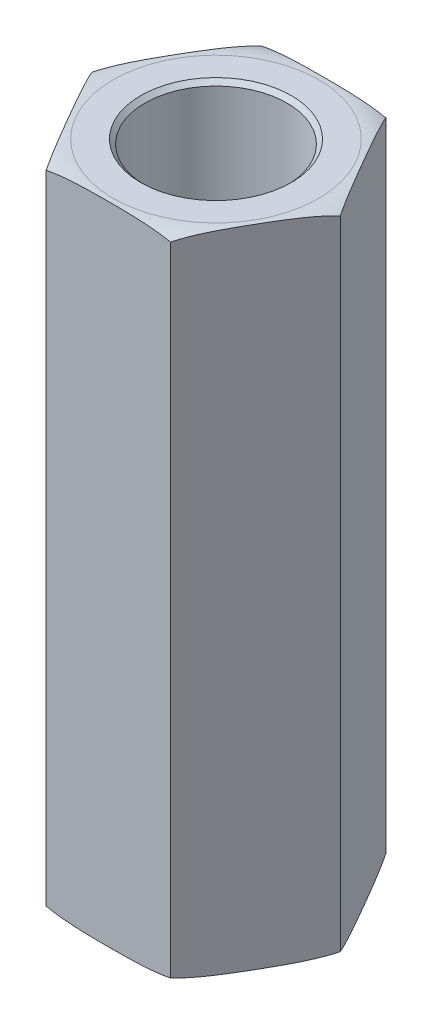
ISO-10303-21;
HEADER;
FILE_DESCRIPTION(('STEP AP214'),'2;1');
FILE_NAME('part.step','',(''),(''),'','','');
FILE_SCHEMA(('AUTOMOTIVE_DESIGN { 1 0 10303 214 1 1 1 1 }'));
ENDSEC;
DATA;
#1=APPLICATION_CONTEXT('core data for automotive mechanical design processes');
#2=APPLICATION_PROTOCOL_DEFINITION('international standard','automotive_design',2000,#1);
#3=PRODUCT_CONTEXT('',#1,'mechanical');
#4=PRODUCT('Part','Part','',(#3));
#5=PRODUCT_RELATED_PRODUCT_CATEGORY('part','',(#4));
#6=PRODUCT_DEFINITION_FORMATION('','',#4);
#7=PRODUCT_DEFINITION_CONTEXT('part definition',#1,'design');
#8=PRODUCT_DEFINITION('design','',#6,#7);
#9=PRODUCT_DEFINITION_SHAPE('','',#8);
#10=(LENGTH_UNIT() NAMED_UNIT(*) SI_UNIT(.MILLI.,.METRE.));
#11=(NAMED_UNIT(*) PLANE_ANGLE_UNIT() SI_UNIT($,.RADIAN.));
#12=(NAMED_UNIT(*) SI_UNIT($,.STERADIAN.) SOLID_ANGLE_UNIT());
#13=UNCERTAINTY_MEASURE_WITH_UNIT(LENGTH_MEASURE(1.E-05),#10,'distance_accuracy_value','');
#14=(GEOMETRIC_REPRESENTATION_CONTEXT(3) GLOBAL_UNCERTAINTY_ASSIGNED_CONTEXT((#13)) GLOBAL_UNIT_ASSIGNED_CONTEXT((#10,
#11,#12)) REPRESENTATION_CONTEXT('',''));
#15=CARTESIAN_POINT('',(0.,0.,0.));
#16=DIRECTION('',(0.,0.,1.));
#17=DIRECTION('',(1.,0.,0.));
#18=AXIS2_PLACEMENT_3D('',#15,#16,#17);
#19=CARTESIAN_POINT('',(3.66617420935412,9.525,0.));
#20=DIRECTION('',(-0.866025403784439,0.,0.5));
#21=DIRECTION('',(0.5,0.,0.866025403784439));
#22=AXIS2_PLACEMENT_3D('',#19,#20,#21);
#23=PLANE('',#22);
#24=CARTESIAN_POINT('',(3.66617420935412,9.398,0.));
#25=CARTESIAN_POINT('',(3.63753042799203,9.40993202468709,-0.0496124846400275));
#26=CARTESIAN_POINT('',(3.60875945805376,9.42055614694223,-0.0994452663561576));
#27=CARTESIAN_POINT('',(3.5510445941875,9.43952869380446,-0.199410342924434));
#28=CARTESIAN_POINT('',(3.52210079717004,9.44787829008084,-0.249542469922636));
#29=CARTESIAN_POINT('',(3.43520914920621,9.47001015084215,-0.400043218949384));
#30=CARTESIAN_POINT('',(3.37708055050429,9.48092253839952,-0.500724905273881));
#31=CARTESIAN_POINT('',(3.26070078255249,9.4975474670846,-0.702300576339476));
#32=CARTESIAN_POINT('',(3.20244972255356,9.50326351393611,-0.803194371852361));
#33=CARTESIAN_POINT('',(3.08586365366197,9.51154325238667,-1.00512736662733));
#34=CARTESIAN_POINT('',(3.02752861562773,9.5141051045623,-1.1061666163641));
#35=CARTESIAN_POINT('',(2.91138213832281,9.5174800878033,-1.30733821617637));
#36=CARTESIAN_POINT('',(2.85357078573453,9.51830898530758,-1.40747041611355));
#37=CARTESIAN_POINT('',(2.73795502274299,9.51890235146376,-1.60772279177072));
#38=CARTESIAN_POINT('',(2.68015061252642,9.51866697200316,-1.70784296716739));
#39=CARTESIAN_POINT('',(2.56452713843041,9.51693398748164,-1.9081086988493));
#40=CARTESIAN_POINT('',(2.50670807591217,9.51543597123025,-2.00825425277689));
#41=CARTESIAN_POINT('',(2.39109525560102,9.51017531674577,-2.20850153156214));
#42=CARTESIAN_POINT('',(2.33330149587798,9.50641290136093,-2.30860325976287));
#43=CARTESIAN_POINT('',(2.23849359853911,9.49698899303816,-2.47281535491256));
#44=CARTESIAN_POINT('',(2.20145192539195,9.49249057663768,-2.5369734148008));
#45=CARTESIAN_POINT('',(2.12747060706785,9.48130148199487,-2.66511281694908));
#46=CARTESIAN_POINT('',(2.09053091530161,9.47461207209161,-2.72909423990413));
#47=CARTESIAN_POINT('',(2.01669860633929,9.45839780386584,-2.85697555026699));
#48=CARTESIAN_POINT('',(1.97980639337021,9.44886525006224,-2.92087473753309));
#49=CARTESIAN_POINT('',(1.90623831426152,9.42626291445617,-3.04829838836459));
#50=CARTESIAN_POINT('',(1.86956287153406,9.41318767878213,-3.11182211855863));
#51=CARTESIAN_POINT('',(1.83308710467706,9.398,-3.175));
#52=B_SPLINE_CURVE_WITH_KNOTS('',3,(#24,#25,#26,#27,#28,#29,#30,#31,#32,#33,#34,#35,#36,#37,#38,
#39,#40,#41,#42,#43,#44,#45,#46,#47,#48,#49,#50,#51),.UNSPECIFIED.,.F.,.F.,(4,2,2,2,2,2,2,2,2,2,
2,2,2,4),(0.,0.17550946738822,0.350928353443244,0.701031261588482,1.05089779629354,
1.40096826525493,1.74783967758031,2.09466158796881,2.44159648808703,2.78849725058543,
3.0111319819994,3.23363806003511,3.45675194236245,3.68021127402553),.UNSPECIFIED.);
#53=CARTESIAN_POINT('',(3.66617420935412,9.398,0.));
#54=VERTEX_POINT('',#53);
#55=CARTESIAN_POINT('',(1.83308710467706,9.398,-3.175));
#56=VERTEX_POINT('',#55);
#57=EDGE_CURVE('E106',#54,#56,#52,.T.);
#58=ORIENTED_EDGE('',*,*,#57,.F.);
#59=DIRECTION('',(0.,1.,0.));
#60=VECTOR('',#59,1.);
#61=CARTESIAN_POINT('',(3.66617420935412,9.525,0.));
#62=LINE('',#61,#60);
#63=CARTESIAN_POINT('',(3.66617420935412,-9.398,0.));
#64=VERTEX_POINT('',#63);
#65=EDGE_CURVE('E79',#54,#64,#62,.F.);
#66=ORIENTED_EDGE('',*,*,#65,.T.);
#67=CARTESIAN_POINT('',(1.83308710467705,-9.398,-3.17500000000001));
#68=CARTESIAN_POINT('',(1.86173088603914,-9.40993202468709,-3.12538751535998));
#69=CARTESIAN_POINT('',(1.89050185597741,-9.42055614694223,-3.07555473364385));
#70=CARTESIAN_POINT('',(1.94821671984367,-9.43952869380445,-2.97558965707558));
#71=CARTESIAN_POINT('',(1.97716051686113,-9.44787829008084,-2.92545753007738));
#72=CARTESIAN_POINT('',(2.06405216482496,-9.47001015084215,-2.77495678105063));
#73=CARTESIAN_POINT('',(2.12218076352687,-9.48092253839952,-2.67427509472614));
#74=CARTESIAN_POINT('',(2.23856053147867,-9.4975474670846,-2.47269942366054));
#75=CARTESIAN_POINT('',(2.2968115914776,-9.50326351393611,-2.37180562814766));
#76=CARTESIAN_POINT('',(2.41339766036919,-9.51154325238667,-2.1698726333727));
#77=CARTESIAN_POINT('',(2.47173269840343,-9.5141051045623,-2.06883338363593));
#78=CARTESIAN_POINT('',(2.58787917570835,-9.5174800878033,-1.86766178382366));
#79=CARTESIAN_POINT('',(2.64569052829663,-9.51830898530758,-1.76752958388648));
#80=CARTESIAN_POINT('',(2.76130629128816,-9.51890235146376,-1.56727720822931));
#81=CARTESIAN_POINT('',(2.81911070150473,-9.51866697200316,-1.46715703283265));
#82=CARTESIAN_POINT('',(2.93473417560074,-9.51693398748165,-1.26689130115074));
#83=CARTESIAN_POINT('',(2.99255323811898,-9.51543597123026,-1.16674574722316));
#84=CARTESIAN_POINT('',(3.10816605843013,-9.51017531674577,-0.966498468437907));
#85=CARTESIAN_POINT('',(3.16595981815317,-9.50641290136093,-0.866396740237176));
#86=CARTESIAN_POINT('',(3.26076771549203,-9.49698899303816,-0.702184645087488));
#87=CARTESIAN_POINT('',(3.2978093886392,-9.49249057663768,-0.63802658519924));
#88=CARTESIAN_POINT('',(3.37179070696331,-9.48130148199488,-0.509887183050958));
#89=CARTESIAN_POINT('',(3.40873039872954,-9.47461207209161,-0.445905760095904));
#90=CARTESIAN_POINT('',(3.48256270769187,-9.45839780386584,-0.318024449733033));
#91=CARTESIAN_POINT('',(3.51945492066095,-9.44886525006225,-0.254125262466928));
#92=CARTESIAN_POINT('',(3.59302299976965,-9.42626291445618,-0.126701611635421));
#93=CARTESIAN_POINT('',(3.62969844249711,-9.41318767878214,-0.0631778814413773));
#94=CARTESIAN_POINT('',(3.66617420935412,-9.398,0.));
#95=B_SPLINE_CURVE_WITH_KNOTS('',3,(#67,#68,#69,#70,#71,#72,#73,#74,#75,#76,#77,#78,#79,#80,#81,
#82,#83,#84,#85,#86,#87,#88,#89,#90,#91,#92,#93,#94),.UNSPECIFIED.,.F.,.F.,(4,2,2,2,2,2,2,2,2,2,
2,2,2,4),(0.,0.175509467388216,0.350928353443236,0.701031261588468,1.05089779629352,
1.4009682652549,1.74783967758028,2.09466158796877,2.44159648808698,2.78849725058538,
3.01113198199936,3.23363806003509,3.45675194236244,3.68021127402553),.UNSPECIFIED.);
#96=CARTESIAN_POINT('',(1.83308710467705,-9.398,-3.175));
#97=VERTEX_POINT('',#96);
#98=EDGE_CURVE('E96',#97,#64,#95,.T.);
#99=ORIENTED_EDGE('',*,*,#98,.F.);
#100=DIRECTION('',(0.,1.,0.));
#101=VECTOR('',#100,1.);
#102=CARTESIAN_POINT('',(1.83308710467705,9.525,-3.175));
#103=LINE('',#102,#101);
#104=EDGE_CURVE('E110',#97,#56,#103,.T.);
#105=ORIENTED_EDGE('',*,*,#104,.T.);
#106=EDGE_LOOP('',(#58,#66,#99,#105));
#107=FACE_BOUND('',#106,.T.);
#108=ADVANCED_FACE('F16',(#107),#23,.F.);
#109=CARTESIAN_POINT('',(1.83308710467706,9.525,3.17499999999999));
#110=DIRECTION('',(-0.866025403784439,0.,-0.5));
#111=DIRECTION('',(-0.5,0.,0.866025403784439));
#112=AXIS2_PLACEMENT_3D('',#109,#110,#111);
#113=PLANE('',#112);
#114=CARTESIAN_POINT('',(1.83308710467706,9.398,3.17499999999999));
#115=CARTESIAN_POINT('',(1.86173088603915,9.40993202468709,3.12538751535996));
#116=CARTESIAN_POINT('',(1.89050185597743,9.42055614694223,3.07555473364383));
#117=CARTESIAN_POINT('',(1.94821671984368,9.43952869380446,2.97558965707556));
#118=CARTESIAN_POINT('',(1.97716051686114,9.44787829008084,2.92545753007735));
#119=CARTESIAN_POINT('',(2.06405216482498,9.47001015084215,2.77495678105061));
#120=CARTESIAN_POINT('',(2.12218076352689,9.48092253839952,2.67427509472611));
#121=CARTESIAN_POINT('',(2.23856053147869,9.4975474670846,2.47269942366051));
#122=CARTESIAN_POINT('',(2.29681159147762,9.50326351393611,2.37180562814763));
#123=CARTESIAN_POINT('',(2.41339766036921,9.51154325238667,2.16987263337266));
#124=CARTESIAN_POINT('',(2.47173269840345,9.5141051045623,2.06883338363589));
#125=CARTESIAN_POINT('',(2.58787917570837,9.5174800878033,1.86766178382362));
#126=CARTESIAN_POINT('',(2.64569052829666,9.51830898530758,1.76752958388644));
#127=CARTESIAN_POINT('',(2.76130629128819,9.51890235146376,1.56727720822927));
#128=CARTESIAN_POINT('',(2.81911070150476,9.51866697200316,1.4671570328326));
#129=CARTESIAN_POINT('',(2.93473417560078,9.51693398748164,1.26689130115069));
#130=CARTESIAN_POINT('',(2.99255323811901,9.51543597123025,1.1667457472231));
#131=CARTESIAN_POINT('',(3.10816605843017,9.51017531674577,0.966498468437848));
#132=CARTESIAN_POINT('',(3.16595981815321,9.50641290136093,0.866396740237115));
#133=CARTESIAN_POINT('',(3.26076771549207,9.49698899303816,0.702184645087431));
#134=CARTESIAN_POINT('',(3.29780938863923,9.49249057663768,0.638026585199189));
#135=CARTESIAN_POINT('',(3.37179070696333,9.48130148199487,0.509887183050919));
#136=CARTESIAN_POINT('',(3.40873039872956,9.47461207209161,0.44590576009587));
#137=CARTESIAN_POINT('',(3.48256270769188,9.45839780386584,0.31802444973301));
#138=CARTESIAN_POINT('',(3.51945492066096,9.44886525006224,0.254125262466912));
#139=CARTESIAN_POINT('',(3.59302299976965,9.42626291445617,0.126701611635416));
#140=CARTESIAN_POINT('',(3.62969844249711,9.41318767878213,0.0631778814413771));
#141=CARTESIAN_POINT('',(3.66617420935412,9.398,0.));
#142=B_SPLINE_CURVE_WITH_KNOTS('',3,(#114,#115,#116,#117,#118,#119,#120,#121,#122,#123,#124,
#125,#126,#127,#128,#129,#130,#131,#132,#133,#134,#135,#136,#137,#138,#139,#140,#141),
.UNSPECIFIED.,.F.,.F.,(4,2,2,2,2,2,2,2,2,2,2,2,2,4),(0.,0.17550946738822,0.350928353443244,
0.701031261588483,1.05089779629354,1.40096826525493,1.74783967758031,2.09466158796881,
2.44159648808703,2.78849725058544,3.01113198199939,3.2336380600351,3.45675194236244,
3.68021127402551),.UNSPECIFIED.);
#143=CARTESIAN_POINT('',(1.83308710467707,9.398,3.17499999999999));
#144=VERTEX_POINT('',#143);
#145=EDGE_CURVE('E21',#144,#54,#142,.T.);
#146=ORIENTED_EDGE('',*,*,#145,.F.);
#147=DIRECTION('',(0.,1.,0.));
#148=VECTOR('',#147,1.);
#149=CARTESIAN_POINT('',(1.83308710467707,9.525,3.17499999999999));
#150=LINE('',#149,#148);
#151=CARTESIAN_POINT('',(1.83308710467706,-9.398,3.17499999999999));
#152=VERTEX_POINT('',#151);
#153=EDGE_CURVE('E99',#144,#152,#150,.F.);
#154=ORIENTED_EDGE('',*,*,#153,.T.);
#155=CARTESIAN_POINT('',(3.66617420935412,-9.398,0.));
#156=CARTESIAN_POINT('',(3.63753042799203,-9.40993202468709,0.0496124846400324));
#157=CARTESIAN_POINT('',(3.60875945805375,-9.42055614694223,0.0994452663561624));
#158=CARTESIAN_POINT('',(3.5510445941875,-9.43952869380445,0.199410342924438));
#159=CARTESIAN_POINT('',(3.52210079717004,-9.44787829008084,0.24954246992264));
#160=CARTESIAN_POINT('',(3.43520914920621,-9.47001015084215,0.400043218949389));
#161=CARTESIAN_POINT('',(3.37708055050429,-9.48092253839952,0.500724905273886));
#162=CARTESIAN_POINT('',(3.26070078255249,-9.4975474670846,0.702300576339482));
#163=CARTESIAN_POINT('',(3.20244972255356,-9.50326351393611,0.803194371852367));
#164=CARTESIAN_POINT('',(3.08586365366197,-9.51154325238667,1.00512736662734));
#165=CARTESIAN_POINT('',(3.02752861562773,-9.5141051045623,1.1061666163641));
#166=CARTESIAN_POINT('',(2.91138213832281,-9.5174800878033,1.30733821617637));
#167=CARTESIAN_POINT('',(2.85357078573452,-9.51830898530758,1.40747041611356));
#168=CARTESIAN_POINT('',(2.73795502274299,-9.51890235146376,1.60772279177073));
#169=CARTESIAN_POINT('',(2.68015061252642,-9.51866697200316,1.70784296716739));
#170=CARTESIAN_POINT('',(2.5645271384304,-9.51693398748164,1.90810869884931));
#171=CARTESIAN_POINT('',(2.50670807591217,-9.51543597123025,2.00825425277689));
#172=CARTESIAN_POINT('',(2.39109525560101,-9.51017531674577,2.20850153156215));
#173=CARTESIAN_POINT('',(2.33330149587797,-9.50641290136093,2.30860325976288));
#174=CARTESIAN_POINT('',(2.23849359853911,-9.49698899303816,2.47281535491257));
#175=CARTESIAN_POINT('',(2.20145192539195,-9.49249057663768,2.53697341480081));
#176=CARTESIAN_POINT('',(2.12747060706785,-9.48130148199487,2.66511281694908));
#177=CARTESIAN_POINT('',(2.09053091530162,-9.47461207209161,2.72909423990413));
#178=CARTESIAN_POINT('',(2.0166986063393,-9.45839780386584,2.85697555026699));
#179=CARTESIAN_POINT('',(1.97980639337022,-9.44886525006225,2.92087473753308));
#180=CARTESIAN_POINT('',(1.90623831426153,-9.42626291445618,3.04829838836458));
#181=CARTESIAN_POINT('',(1.86956287153407,-9.41318767878214,3.11182211855862));
#182=CARTESIAN_POINT('',(1.83308710467706,-9.398,3.17499999999999));
#183=B_SPLINE_CURVE_WITH_KNOTS('',3,(#155,#156,#157,#158,#159,#160,#161,#162,#163,#164,#165,
#166,#167,#168,#169,#170,#171,#172,#173,#174,#175,#176,#177,#178,#179,#180,#181,#182),
.UNSPECIFIED.,.F.,.F.,(4,2,2,2,2,2,2,2,2,2,2,2,2,4),(0.,0.175509467388219,0.350928353443244,
0.701031261588483,1.05089779629354,1.40096826525493,1.74783967758031,2.09466158796881,
2.44159648808703,2.78849725058544,3.01113198199939,3.2336380600351,3.45675194236244,
3.68021127402551),.UNSPECIFIED.);
#184=EDGE_CURVE('E204',#64,#152,#183,.T.);
#185=ORIENTED_EDGE('',*,*,#184,.F.);
#186=ORIENTED_EDGE('',*,*,#65,.F.);
#187=EDGE_LOOP('',(#146,#154,#185,#186));
#188=FACE_BOUND('',#187,.T.);
#189=ADVANCED_FACE('F105',(#188),#113,.F.);
#190=CARTESIAN_POINT('',(-1.83308710467707,9.525,3.175));
#191=DIRECTION('',(0.,0.,-1.));
#192=DIRECTION('',(-1.,0.,0.));
#193=AXIS2_PLACEMENT_3D('',#190,#191,#192);
#194=PLANE('',#193);
#195=ORIENTED_EDGE('',*,*,#153,.F.);
#196=CARTESIAN_POINT('',(-1.83308710467707,9.39799999999999,3.175));
#197=CARTESIAN_POINT('',(-1.75760871054776,9.41371230122365,3.175));
#198=CARTESIAN_POINT('',(-1.68170571468658,9.4271647800808,3.175));
#199=CARTESIAN_POINT('',(-1.52939807527773,9.45030486470105,3.175));
#200=CARTESIAN_POINT('',(-1.45299400110163,9.45999617502722,3.175));
#201=CARTESIAN_POINT('',(-1.30011823209763,9.47637135267139,3.175));
#202=CARTESIAN_POINT('',(-1.22364747610196,9.48306442247852,3.175));
#203=CARTESIAN_POINT('',(-1.07052459410173,9.49417241699752,3.175));
#204=CARTESIAN_POINT('',(-0.993872424115956,9.49858671655426,3.175));
#205=CARTESIAN_POINT('',(-0.840856910195845,9.50572419802799,3.175));
#206=CARTESIAN_POINT('',(-0.764493913329281,9.50845527367792,3.175));
#207=CARTESIAN_POINT('',(-0.611734616938516,9.51275632258004,3.175));
#208=CARTESIAN_POINT('',(-0.535338316331409,9.51432625473884,3.175));
#209=CARTESIAN_POINT('',(-0.38245423122642,9.51668247076568,3.175));
#210=CARTESIAN_POINT('',(-0.305966435115039,9.51746792759645,3.175));
#211=CARTESIAN_POINT('',(-0.152985759387012,9.51848841069005,3.175));
#212=CARTESIAN_POINT('',(-0.076492879693506,9.51872342414921,3.175));
#213=CARTESIAN_POINT('',(0.0764928796935065,9.51872342414921,3.175));
#214=CARTESIAN_POINT('',(0.152985759387013,9.51848841069005,3.17499999999999));
#215=CARTESIAN_POINT('',(0.305966435115039,9.51746792759645,3.17499999999999));
#216=CARTESIAN_POINT('',(0.38245423122642,9.51668247076568,3.17499999999999));
#217=CARTESIAN_POINT('',(0.535338316331409,9.51432625473884,3.17499999999999));
#218=CARTESIAN_POINT('',(0.611734616938516,9.51275632258004,3.17499999999999));
#219=CARTESIAN_POINT('',(0.764493913329281,9.50845527367792,3.17499999999999));
#220=CARTESIAN_POINT('',(0.840856910195845,9.50572419802799,3.17499999999999));
#221=CARTESIAN_POINT('',(0.993872424115955,9.49858671655426,3.17499999999999));
#222=CARTESIAN_POINT('',(1.07052459410172,9.49417241699752,3.17499999999999));
#223=CARTESIAN_POINT('',(1.22364747610196,9.48306442247852,3.17499999999999));
#224=CARTESIAN_POINT('',(1.30011823209763,9.47637135267139,3.17499999999999));
#225=CARTESIAN_POINT('',(1.45299400110163,9.45999617502723,3.17499999999999));
#226=CARTESIAN_POINT('',(1.52939807527773,9.45030486470105,3.17499999999999));
#227=CARTESIAN_POINT('',(1.68170571468658,9.42716478008081,3.17499999999999));
#228=CARTESIAN_POINT('',(1.75760871054776,9.41371230122365,3.17499999999999));
#229=CARTESIAN_POINT('',(1.83308710467707,9.398,3.17499999999999));
#230=B_SPLINE_CURVE_WITH_KNOTS('',3,(#196,#197,#198,#199,#200,#201,#202,#203,#204,#205,#206,
#207,#208,#209,#210,#211,#212,#213,#214,#215,#216,#217,#218,#219,#220,#221,#222,#223,#224,#225,
#226,#227,#228,#229),.UNSPECIFIED.,.F.,.F.,(4,2,2,2,2,2,2,2,2,2,2,2,2,2,2,2,4),(0.,
0.23119079437731,0.46215329593589,0.692401964780504,0.922713766248053,1.15193709952408,
1.3811685447265,1.61064140410055,1.84011960111017,2.06959779811978,2.29907065749383,
2.52830210269626,2.75752543597228,2.98783723743982,3.21808590628444,3.44904840784302,
3.68023920222033),.UNSPECIFIED.);
#231=CARTESIAN_POINT('',(-1.83308710467707,9.398,3.175));
#232=VERTEX_POINT('',#231);
#233=EDGE_CURVE('E85',#232,#144,#230,.T.);
#234=ORIENTED_EDGE('',*,*,#233,.F.);
#235=DIRECTION('',(0.,1.,0.));
#236=VECTOR('',#235,1.);
#237=CARTESIAN_POINT('',(-1.83308710467707,9.525,3.175));
#238=LINE('',#237,#236);
#239=CARTESIAN_POINT('',(-1.83308710467707,-9.398,3.175));
#240=VERTEX_POINT('',#239);
#241=EDGE_CURVE('E103',#232,#240,#238,.F.);
#242=ORIENTED_EDGE('',*,*,#241,.T.);
#243=CARTESIAN_POINT('',(1.83308710467706,-9.398,3.17499999999999));
#244=CARTESIAN_POINT('',(1.75760871054776,-9.41371230122365,3.17499999999999));
#245=CARTESIAN_POINT('',(1.68170571468658,-9.42716478008081,3.17499999999999));
#246=CARTESIAN_POINT('',(1.52939807527773,-9.45030486470105,3.17499999999999));
#247=CARTESIAN_POINT('',(1.45299400110163,-9.45999617502723,3.17499999999999));
#248=CARTESIAN_POINT('',(1.30011823209763,-9.47637135267139,3.17499999999999));
#249=CARTESIAN_POINT('',(1.22364747610196,-9.48306442247852,3.17499999999999));
#250=CARTESIAN_POINT('',(1.07052459410172,-9.49417241699752,3.17499999999999));
#251=CARTESIAN_POINT('',(0.993872424115954,-9.49858671655426,3.17499999999999));
#252=CARTESIAN_POINT('',(0.840856910195844,-9.50572419802799,3.17499999999999));
#253=CARTESIAN_POINT('',(0.76449391332928,-9.50845527367792,3.17499999999999));
#254=CARTESIAN_POINT('',(0.611734616938514,-9.51275632258004,3.17499999999999));
#255=CARTESIAN_POINT('',(0.535338316331408,-9.51432625473884,3.17499999999999));
#256=CARTESIAN_POINT('',(0.382454231226419,-9.51668247076568,3.17499999999999));
#257=CARTESIAN_POINT('',(0.305966435115038,-9.51746792759645,3.17499999999999));
#258=CARTESIAN_POINT('',(0.152985759387012,-9.51848841069005,3.17499999999999));
#259=CARTESIAN_POINT('',(0.076492879693506,-9.51872342414921,3.175));
#260=CARTESIAN_POINT('',(-0.0764928796935062,-9.51872342414921,3.175));
#261=CARTESIAN_POINT('',(-0.152985759387012,-9.51848841069005,3.175));
#262=CARTESIAN_POINT('',(-0.305966435115038,-9.51746792759645,3.175));
#263=CARTESIAN_POINT('',(-0.382454231226419,-9.51668247076568,3.175));
#264=CARTESIAN_POINT('',(-0.535338316331408,-9.51432625473884,3.175));
#265=CARTESIAN_POINT('',(-0.611734616938515,-9.51275632258004,3.175));
#266=CARTESIAN_POINT('',(-0.76449391332928,-9.50845527367792,3.175));
#267=CARTESIAN_POINT('',(-0.840856910195844,-9.50572419802799,3.175));
#268=CARTESIAN_POINT('',(-0.993872424115954,-9.49858671655426,3.175));
#269=CARTESIAN_POINT('',(-1.07052459410172,-9.49417241699752,3.175));
#270=CARTESIAN_POINT('',(-1.22364747610196,-9.48306442247852,3.175));
#271=CARTESIAN_POINT('',(-1.30011823209763,-9.47637135267139,3.175));
#272=CARTESIAN_POINT('',(-1.45299400110163,-9.45999617502722,3.175));
#273=CARTESIAN_POINT('',(-1.52939807527773,-9.45030486470105,3.175));
#274=CARTESIAN_POINT('',(-1.68170571468658,-9.4271647800808,3.175));
#275=CARTESIAN_POINT('',(-1.75760871054776,-9.41371230122365,3.175));
#276=CARTESIAN_POINT('',(-1.83308710467706,-9.398,3.175));
#277=B_SPLINE_CURVE_WITH_KNOTS('',3,(#243,#244,#245,#246,#247,#248,#249,#250,#251,#252,#253,
#254,#255,#256,#257,#258,#259,#260,#261,#262,#263,#264,#265,#266,#267,#268,#269,#270,#271,#272,
#273,#274,#275,#276),.UNSPECIFIED.,.F.,.F.,(4,2,2,2,2,2,2,2,2,2,2,2,2,2,2,2,4),(0.,
0.23119079437731,0.462153295935889,0.692401964780503,0.922713766248051,1.15193709952407,
1.3811685447265,1.61064140410055,1.84011960111016,2.06959779811977,2.29907065749383,
2.52830210269625,2.75752543597227,2.98783723743982,3.21808590628443,3.44904840784301,
3.68023920222032),.UNSPECIFIED.);
#278=EDGE_CURVE('E101',#152,#240,#277,.T.);
#279=ORIENTED_EDGE('',*,*,#278,.F.);
#280=EDGE_LOOP('',(#195,#234,#242,#279));
#281=FACE_BOUND('',#280,.T.);
#282=ADVANCED_FACE('F100',(#281),#194,.F.);
#283=CARTESIAN_POINT('',(-3.66617420935413,9.525,0.));
#284=DIRECTION('',(0.866025403784439,0.,-0.499999999999999));
#285=DIRECTION('',(-0.499999999999999,0.,-0.866025403784439));
#286=AXIS2_PLACEMENT_3D('',#283,#284,#285);
#287=PLANE('',#286);
#288=CARTESIAN_POINT('',(-3.66617420935412,9.39799999999999,0.));
#289=CARTESIAN_POINT('',(-3.63753042799204,9.40993202468708,0.0496124846400222));
#290=CARTESIAN_POINT('',(-3.60875945805377,9.42055614694222,0.0994452663561455));
#291=CARTESIAN_POINT('',(-3.55104459418752,9.43952869380445,0.199410342924408));
#292=CARTESIAN_POINT('',(-3.52210079717006,9.44787829008083,0.249542469922603));
#293=CARTESIAN_POINT('',(-3.43520914920624,9.47001015084215,0.400043218949332));
#294=CARTESIAN_POINT('',(-3.37708055050434,9.48092253839951,0.500724905273816));
#295=CARTESIAN_POINT('',(-3.26070078255255,9.4975474670846,0.702300576339384));
#296=CARTESIAN_POINT('',(-3.20244972255363,9.50326351393611,0.803194371852256));
#297=CARTESIAN_POINT('',(-3.08586365366205,9.51154325238667,1.0051273666272));
#298=CARTESIAN_POINT('',(-3.02752861562782,9.5141051045623,1.10616661636395));
#299=CARTESIAN_POINT('',(-2.91138213832292,9.5174800878033,1.30733821617619));
#300=CARTESIAN_POINT('',(-2.85357078573464,9.51830898530758,1.40747041611336));
#301=CARTESIAN_POINT('',(-2.73795502274313,9.51890235146376,1.60772279177051));
#302=CARTESIAN_POINT('',(-2.68015061252656,9.51866697200317,1.70784296716716));
#303=CARTESIAN_POINT('',(-2.56452713843056,9.51693398748165,1.90810869884905));
#304=CARTESIAN_POINT('',(-2.50670807591233,9.51543597123026,2.00825425277662));
#305=CARTESIAN_POINT('',(-2.39109525560119,9.51017531674578,2.20850153156185));
#306=CARTESIAN_POINT('',(-2.33330149587816,9.50641290136095,2.30860325976257));
#307=CARTESIAN_POINT('',(-2.23849359853929,9.49698899303818,2.47281535491227));
#308=CARTESIAN_POINT('',(-2.20145192539211,9.4924905766377,2.53697341480054));
#309=CARTESIAN_POINT('',(-2.12747060706798,9.48130148199489,2.66511281694887));
#310=CARTESIAN_POINT('',(-2.09053091530173,9.47461207209163,2.72909423990394));
#311=CARTESIAN_POINT('',(-2.01669860633938,9.45839780386585,2.85697555026686));
#312=CARTESIAN_POINT('',(-1.97980639337028,9.44886525006226,2.92087473753298));
#313=CARTESIAN_POINT('',(-1.90623831426156,9.42626291445618,3.04829838836453));
#314=CARTESIAN_POINT('',(-1.86956287153409,9.41318767878214,3.1118221185586));
#315=CARTESIAN_POINT('',(-1.83308710467707,9.39799999999999,3.175));
#316=B_SPLINE_CURVE_WITH_KNOTS('',3,(#288,#289,#290,#291,#292,#293,#294,#295,#296,#297,#298,
#299,#300,#301,#302,#303,#304,#305,#306,#307,#308,#309,#310,#311,#312,#313,#314,#315),
.UNSPECIFIED.,.F.,.F.,(4,2,2,2,2,2,2,2,2,2,2,2,2,4),(0.,0.175509467388196,0.350928353443197,
0.70103126158839,1.0508977962934,1.40096826525474,1.74783967758008,2.09466158796853,
2.4415964880867,2.78849725058507,3.01113198199912,3.23363806003492,3.45675194236235,
3.68021127402552),.UNSPECIFIED.);
#317=CARTESIAN_POINT('',(-3.66617420935413,9.39799999999999,0.));
#318=VERTEX_POINT('',#317);
#319=EDGE_CURVE('E93',#318,#232,#316,.T.);
#320=ORIENTED_EDGE('',*,*,#319,.F.);
#321=DIRECTION('',(0.,1.,0.));
#322=VECTOR('',#321,1.);
#323=CARTESIAN_POINT('',(-3.66617420935413,9.525,0.));
#324=LINE('',#323,#322);
#325=CARTESIAN_POINT('',(-3.66617420935413,-9.398,0.));
#326=VERTEX_POINT('',#325);
#327=EDGE_CURVE('E117',#318,#326,#324,.F.);
#328=ORIENTED_EDGE('',*,*,#327,.T.);
#329=CARTESIAN_POINT('',(-1.83308710467707,-9.39799999999999,3.175));
#330=CARTESIAN_POINT('',(-1.86173088603915,-9.40993202468708,3.12538751535998));
#331=CARTESIAN_POINT('',(-1.89050185597742,-9.42055614694222,3.07555473364385));
#332=CARTESIAN_POINT('',(-1.94821671984367,-9.43952869380445,2.97558965707558));
#333=CARTESIAN_POINT('',(-1.97716051686113,-9.44787829008083,2.92545753007739));
#334=CARTESIAN_POINT('',(-2.06405216482496,-9.47001015084215,2.77495678105065));
#335=CARTESIAN_POINT('',(-2.12218076352686,-9.48092253839952,2.67427509472617));
#336=CARTESIAN_POINT('',(-2.23856053147865,-9.4975474670846,2.47269942366059));
#337=CARTESIAN_POINT('',(-2.29681159147757,-9.50326351393611,2.37180562814772));
#338=CARTESIAN_POINT('',(-2.41339766036916,-9.51154325238667,2.16987263337277));
#339=CARTESIAN_POINT('',(-2.47173269840339,-9.5141051045623,2.06883338363601));
#340=CARTESIAN_POINT('',(-2.5878791757083,-9.5174800878033,1.86766178382376));
#341=CARTESIAN_POINT('',(-2.64569052829658,-9.51830898530758,1.76752958388659));
#342=CARTESIAN_POINT('',(-2.7613062912881,-9.51890235146376,1.56727720822944));
#343=CARTESIAN_POINT('',(-2.81911070150467,-9.51866697200316,1.46715703283278));
#344=CARTESIAN_POINT('',(-2.93473417560067,-9.51693398748165,1.26689130115088));
#345=CARTESIAN_POINT('',(-2.9925532381189,-9.51543597123026,1.16674574722331));
#346=CARTESIAN_POINT('',(-3.10816605843004,-9.51017531674578,0.966498468438076));
#347=CARTESIAN_POINT('',(-3.16595981815307,-9.50641290136094,0.866396740237353));
#348=CARTESIAN_POINT('',(-3.26076771549194,-9.49698899303818,0.702184645087658));
#349=CARTESIAN_POINT('',(-3.29780938863912,-9.49249057663769,0.638026585199395));
#350=CARTESIAN_POINT('',(-3.37179070696324,-9.48130148199489,0.509887183051082));
#351=CARTESIAN_POINT('',(-3.40873039872949,-9.47461207209162,0.445905760096013));
#352=CARTESIAN_POINT('',(-3.48256270769183,-9.45839780386585,0.318024449733112));
#353=CARTESIAN_POINT('',(-3.51945492066092,-9.44886525006225,0.254125262466993));
#354=CARTESIAN_POINT('',(-3.59302299976963,-9.42626291445618,0.126701611635455));
#355=CARTESIAN_POINT('',(-3.6296984424971,-9.41318767878214,0.0631778814413959));
#356=CARTESIAN_POINT('',(-3.66617420935412,-9.398,0.));
#357=B_SPLINE_CURVE_WITH_KNOTS('',3,(#329,#330,#331,#332,#333,#334,#335,#336,#337,#338,#339,
#340,#341,#342,#343,#344,#345,#346,#347,#348,#349,#350,#351,#352,#353,#354,#355,#356),
.UNSPECIFIED.,.F.,.F.,(4,2,2,2,2,2,2,2,2,2,2,2,2,4),(0.,0.175509467388203,0.350928353443209,
0.701031261588413,1.05089779629344,1.40096826525479,1.74783967758014,2.0946615879686,
2.44159648808678,2.78849725058516,3.01113198199919,3.23363806003497,3.45675194236238,
3.68021127402552),.UNSPECIFIED.);
#358=EDGE_CURVE('E195',#240,#326,#357,.T.);
#359=ORIENTED_EDGE('',*,*,#358,.F.);
#360=ORIENTED_EDGE('',*,*,#241,.F.);
#361=EDGE_LOOP('',(#320,#328,#359,#360));
#362=FACE_BOUND('',#361,.T.);
#363=ADVANCED_FACE('F189',(#362),#287,.F.);
#364=CARTESIAN_POINT('',(-1.83308710467707,9.525,-3.175));
#365=DIRECTION('',(0.866025403784439,0.,0.5));
#366=DIRECTION('',(0.5,0.,-0.866025403784439));
#367=AXIS2_PLACEMENT_3D('',#364,#365,#366);
#368=PLANE('',#367);
#369=CARTESIAN_POINT('',(-1.83308710467706,9.39799999999999,-3.17500000000001));
#370=CARTESIAN_POINT('',(-1.86173088603915,9.40993202468708,-3.12538751535999));
#371=CARTESIAN_POINT('',(-1.89050185597742,9.42055614694222,-3.07555473364386));
#372=CARTESIAN_POINT('',(-1.94821671984366,9.43952869380445,-2.9755896570756));
#373=CARTESIAN_POINT('',(-1.97716051686112,9.44787829008083,-2.92545753007741));
#374=CARTESIAN_POINT('',(-2.06405216482494,9.47001015084215,-2.77495678105068));
#375=CARTESIAN_POINT('',(-2.12218076352685,9.48092253839951,-2.6742750947262));
#376=CARTESIAN_POINT('',(-2.23856053147863,9.4975474670846,-2.47269942366064));
#377=CARTESIAN_POINT('',(-2.29681159147755,9.50326351393611,-2.37180562814777));
#378=CARTESIAN_POINT('',(-2.41339766036912,9.51154325238667,-2.16987263337283));
#379=CARTESIAN_POINT('',(-2.47173269840336,9.5141051045623,-2.06883338363608));
#380=CARTESIAN_POINT('',(-2.58787917570826,9.5174800878033,-1.86766178382384));
#381=CARTESIAN_POINT('',(-2.64569052829653,9.51830898530758,-1.76752958388667));
#382=CARTESIAN_POINT('',(-2.76130629128805,9.51890235146376,-1.56727720822953));
#383=CARTESIAN_POINT('',(-2.81911070150462,9.51866697200317,-1.46715703283288));
#384=CARTESIAN_POINT('',(-2.93473417560061,9.51693398748165,-1.26689130115099));
#385=CARTESIAN_POINT('',(-2.99255323811884,9.51543597123026,-1.16674574722342));
#386=CARTESIAN_POINT('',(-3.10816605842998,9.51017531674579,-0.966498468438198));
#387=CARTESIAN_POINT('',(-3.16595981815301,9.50641290136095,-0.86639674023748));
#388=CARTESIAN_POINT('',(-3.26076771549188,9.49698899303819,-0.702184645087778));
#389=CARTESIAN_POINT('',(-3.29780938863906,9.4924905766377,-0.638026585199504));
#390=CARTESIAN_POINT('',(-3.3717907069632,9.4813014819949,-0.50988718305117));
#391=CARTESIAN_POINT('',(-3.40873039872945,9.47461207209163,-0.44590576009609));
#392=CARTESIAN_POINT('',(-3.4825627076918,9.45839780386586,-0.318024449733166));
#393=CARTESIAN_POINT('',(-3.5194549206609,9.44886525006226,-0.254125262467035));
#394=CARTESIAN_POINT('',(-3.59302299976963,9.42626291445618,-0.126701611635476));
#395=CARTESIAN_POINT('',(-3.6296984424971,9.41318767878213,-0.0631778814414058));
#396=CARTESIAN_POINT('',(-3.66617420935413,9.39799999999999,0.));
#397=B_SPLINE_CURVE_WITH_KNOTS('',3,(#369,#370,#371,#372,#373,#374,#375,#376,#377,#378,#379,
#380,#381,#382,#383,#384,#385,#386,#387,#388,#389,#390,#391,#392,#393,#394,#395,#396),
.UNSPECIFIED.,.F.,.F.,(4,2,2,2,2,2,2,2,2,2,2,2,2,4),(0.,0.175509467388193,0.350928353443191,
0.701031261588377,1.05089779629338,1.40096826525472,1.74783967758005,2.0946615879685,
2.44159648808666,2.78849725058502,3.01113198199908,3.2336380600349,3.45675194236235,
3.68021127402553),.UNSPECIFIED.);
#398=CARTESIAN_POINT('',(-1.83308710467706,9.398,-3.175));
#399=VERTEX_POINT('',#398);
#400=EDGE_CURVE('E165',#399,#318,#397,.T.);
#401=ORIENTED_EDGE('',*,*,#400,.F.);
#402=DIRECTION('',(0.,1.,0.));
#403=VECTOR('',#402,1.);
#404=CARTESIAN_POINT('',(-1.83308710467706,9.525,-3.175));
#405=LINE('',#404,#403);
#406=CARTESIAN_POINT('',(-1.83308710467707,-9.39799999999999,-3.175));
#407=VERTEX_POINT('',#406);
#408=EDGE_CURVE('E107',#399,#407,#405,.F.);
#409=ORIENTED_EDGE('',*,*,#408,.T.);
#410=CARTESIAN_POINT('',(-3.66617420935413,-9.39799999999999,0.));
#411=CARTESIAN_POINT('',(-3.63753042799204,-9.40993202468708,-0.0496124846400259));
#412=CARTESIAN_POINT('',(-3.60875945805377,-9.42055614694222,-0.0994452663561509));
#413=CARTESIAN_POINT('',(-3.55104459418752,-9.43952869380445,-0.199410342924416));
#414=CARTESIAN_POINT('',(-3.52210079717006,-9.44787829008083,-0.249542469922613));
#415=CARTESIAN_POINT('',(-3.43520914920624,-9.47001015084215,-0.400043218949346));
#416=CARTESIAN_POINT('',(-3.37708055050433,-9.48092253839952,-0.500724905273833));
#417=CARTESIAN_POINT('',(-3.26070078255254,-9.4975474670846,-0.702300576339408));
#418=CARTESIAN_POINT('',(-3.20244972255362,-9.50326351393611,-0.803194371852283));
#419=CARTESIAN_POINT('',(-3.08586365366204,-9.51154325238667,-1.00512736662723));
#420=CARTESIAN_POINT('',(-3.0275286156278,-9.5141051045623,-1.10616661636399));
#421=CARTESIAN_POINT('',(-2.91138213832289,-9.5174800878033,-1.30733821617624));
#422=CARTESIAN_POINT('',(-2.85357078573462,-9.51830898530758,-1.40747041611341));
#423=CARTESIAN_POINT('',(-2.7379550227431,-9.51890235146376,-1.60772279177056));
#424=CARTESIAN_POINT('',(-2.68015061252653,-9.51866697200316,-1.70784296716722));
#425=CARTESIAN_POINT('',(-2.56452713843053,-9.51693398748165,-1.90810869884911));
#426=CARTESIAN_POINT('',(-2.5067080759123,-9.51543597123026,-2.00825425277669));
#427=CARTESIAN_POINT('',(-2.39109525560115,-9.51017531674578,-2.20850153156192));
#428=CARTESIAN_POINT('',(-2.33330149587812,-9.50641290136094,-2.30860325976265));
#429=CARTESIAN_POINT('',(-2.23849359853925,-9.49698899303818,-2.47281535491234));
#430=CARTESIAN_POINT('',(-2.20145192539208,-9.49249057663769,-2.53697341480061));
#431=CARTESIAN_POINT('',(-2.12747060706795,-9.48130148199489,-2.66511281694892));
#432=CARTESIAN_POINT('',(-2.09053091530171,-9.47461207209162,-2.72909423990399));
#433=CARTESIAN_POINT('',(-2.01669860633936,-9.45839780386585,-2.85697555026689));
#434=CARTESIAN_POINT('',(-1.97980639337027,-9.44886525006225,-2.92087473753301));
#435=CARTESIAN_POINT('',(-1.90623831426156,-9.42626291445618,-3.04829838836455));
#436=CARTESIAN_POINT('',(-1.86956287153409,-9.41318767878213,-3.11182211855861));
#437=CARTESIAN_POINT('',(-1.83308710467707,-9.39799999999999,-3.175));
#438=B_SPLINE_CURVE_WITH_KNOTS('',3,(#410,#411,#412,#413,#414,#415,#416,#417,#418,#419,#420,
#421,#422,#423,#424,#425,#426,#427,#428,#429,#430,#431,#432,#433,#434,#435,#436,#437),
.UNSPECIFIED.,.F.,.F.,(4,2,2,2,2,2,2,2,2,2,2,2,2,4),(0.,0.175509467388202,0.350928353443208,
0.701031261588412,1.05089779629344,1.40096826525479,1.74783967758014,2.0946615879686,
2.44159648808678,2.78849725058516,3.01113198199919,3.23363806003497,3.45675194236238,
3.68021127402553),.UNSPECIFIED.);
#439=EDGE_CURVE('E141',#326,#407,#438,.T.);
#440=ORIENTED_EDGE('',*,*,#439,.F.);
#441=ORIENTED_EDGE('',*,*,#327,.F.);
#442=EDGE_LOOP('',(#401,#409,#440,#441));
#443=FACE_BOUND('',#442,.T.);
#444=ADVANCED_FACE('F151',(#443),#368,.F.);
#445=CARTESIAN_POINT('',(1.83308710467706,9.525,-3.175));
#446=DIRECTION('',(0.,0.,1.));
#447=DIRECTION('',(1.,0.,0.));
#448=AXIS2_PLACEMENT_3D('',#445,#446,#447);
#449=PLANE('',#448);
#450=CARTESIAN_POINT('',(1.83308710467705,9.398,-3.175));
#451=CARTESIAN_POINT('',(1.75760871054775,9.41371230122365,-3.175));
#452=CARTESIAN_POINT('',(1.68170571468657,9.4271647800808,-3.175));
#453=CARTESIAN_POINT('',(1.52939807527772,9.45030486470105,-3.175));
#454=CARTESIAN_POINT('',(1.45299400110162,9.45999617502722,-3.175));
#455=CARTESIAN_POINT('',(1.30011823209763,9.47637135267139,-3.175));
#456=CARTESIAN_POINT('',(1.22364747610195,9.48306442247852,-3.175));
#457=CARTESIAN_POINT('',(1.07052459410172,9.49417241699752,-3.175));
#458=CARTESIAN_POINT('',(0.99387242411595,9.49858671655426,-3.175));
#459=CARTESIAN_POINT('',(0.84085691019584,9.50572419802799,-3.175));
#460=CARTESIAN_POINT('',(0.764493913329277,9.50845527367792,-3.175));
#461=CARTESIAN_POINT('',(0.611734616938512,9.51275632258004,-3.175));
#462=CARTESIAN_POINT('',(0.535338316331406,9.51432625473884,-3.175));
#463=CARTESIAN_POINT('',(0.382454231226418,9.51668247076568,-3.175));
#464=CARTESIAN_POINT('',(0.305966435115037,9.51746792759645,-3.175));
#465=CARTESIAN_POINT('',(0.152985759387012,9.51848841069005,-3.175));
#466=CARTESIAN_POINT('',(0.0764928796935062,9.51872342414921,-3.175));
#467=CARTESIAN_POINT('',(-0.0764928796935054,9.51872342414921,-3.175));
#468=CARTESIAN_POINT('',(-0.152985759387011,9.51848841069005,-3.175));
#469=CARTESIAN_POINT('',(-0.305966435115037,9.51746792759645,-3.175));
#470=CARTESIAN_POINT('',(-0.382454231226418,9.51668247076568,-3.175));
#471=CARTESIAN_POINT('',(-0.535338316331406,9.51432625473884,-3.175));
#472=CARTESIAN_POINT('',(-0.611734616938512,9.51275632258004,-3.175));
#473=CARTESIAN_POINT('',(-0.764493913329277,9.50845527367792,-3.175));
#474=CARTESIAN_POINT('',(-0.840856910195841,9.50572419802799,-3.175));
#475=CARTESIAN_POINT('',(-0.99387242411595,9.49858671655426,-3.175));
#476=CARTESIAN_POINT('',(-1.07052459410172,9.49417241699752,-3.175));
#477=CARTESIAN_POINT('',(-1.22364747610195,9.48306442247852,-3.175));
#478=CARTESIAN_POINT('',(-1.30011823209763,9.47637135267139,-3.175));
#479=CARTESIAN_POINT('',(-1.45299400110163,9.45999617502722,-3.175));
#480=CARTESIAN_POINT('',(-1.52939807527772,9.45030486470105,-3.175));
#481=CARTESIAN_POINT('',(-1.68170571468657,9.4271647800808,-3.175));
#482=CARTESIAN_POINT('',(-1.75760871054775,9.41371230122365,-3.175));
#483=CARTESIAN_POINT('',(-1.83308710467706,9.39799999999999,-3.175));
#484=B_SPLINE_CURVE_WITH_KNOTS('',3,(#450,#451,#452,#453,#454,#455,#456,#457,#458,#459,#460,
#461,#462,#463,#464,#465,#466,#467,#468,#469,#470,#471,#472,#473,#474,#475,#476,#477,#478,#479,
#480,#481,#482,#483),.UNSPECIFIED.,.F.,.F.,(4,2,2,2,2,2,2,2,2,2,2,2,2,2,2,2,4),(0.,
0.231190794377309,0.462153295935887,0.6924019647805,0.922713766248047,1.15193709952407,
1.38116854472649,1.61064140410054,1.84011960111015,2.06959779811976,2.29907065749382,
2.52830210269624,2.75752543597226,2.98783723743981,3.21808590628442,3.449048407843,
3.68023920222031),.UNSPECIFIED.);
#485=EDGE_CURVE('E108',#56,#399,#484,.T.);
#486=ORIENTED_EDGE('',*,*,#485,.F.);
#487=ORIENTED_EDGE('',*,*,#104,.F.);
#488=CARTESIAN_POINT('',(-1.83308710467707,-9.39799999999999,-3.175));
#489=CARTESIAN_POINT('',(-1.75760871054776,-9.41371230122365,-3.175));
#490=CARTESIAN_POINT('',(-1.68170571468658,-9.4271647800808,-3.175));
#491=CARTESIAN_POINT('',(-1.52939807527773,-9.45030486470105,-3.175));
#492=CARTESIAN_POINT('',(-1.45299400110163,-9.45999617502722,-3.175));
#493=CARTESIAN_POINT('',(-1.30011823209763,-9.47637135267139,-3.175));
#494=CARTESIAN_POINT('',(-1.22364747610196,-9.48306442247852,-3.175));
#495=CARTESIAN_POINT('',(-1.07052459410173,-9.49417241699752,-3.175));
#496=CARTESIAN_POINT('',(-0.993872424115956,-9.49858671655426,-3.175));
#497=CARTESIAN_POINT('',(-0.840856910195846,-9.50572419802799,-3.175));
#498=CARTESIAN_POINT('',(-0.764493913329282,-9.50845527367792,-3.175));
#499=CARTESIAN_POINT('',(-0.611734616938516,-9.51275632258004,-3.175));
#500=CARTESIAN_POINT('',(-0.535338316331409,-9.51432625473884,-3.175));
#501=CARTESIAN_POINT('',(-0.38245423122642,-9.51668247076568,-3.175));
#502=CARTESIAN_POINT('',(-0.305966435115039,-9.51746792759645,-3.175));
#503=CARTESIAN_POINT('',(-0.152985759387013,-9.51848841069005,-3.175));
#504=CARTESIAN_POINT('',(-0.0764928796935069,-9.51872342414921,-3.175));
#505=CARTESIAN_POINT('',(0.0764928796935047,-9.51872342414921,-3.175));
#506=CARTESIAN_POINT('',(0.15298575938701,-9.51848841069005,-3.175));
#507=CARTESIAN_POINT('',(0.305966435115035,-9.51746792759645,-3.175));
#508=CARTESIAN_POINT('',(0.382454231226415,-9.51668247076568,-3.175));
#509=CARTESIAN_POINT('',(0.535338316331403,-9.51432625473884,-3.175));
#510=CARTESIAN_POINT('',(0.611734616938509,-9.51275632258004,-3.175));
#511=CARTESIAN_POINT('',(0.764493913329273,-9.50845527367792,-3.175));
#512=CARTESIAN_POINT('',(0.840856910195836,-9.50572419802799,-3.175));
#513=CARTESIAN_POINT('',(0.993872424115945,-9.49858671655426,-3.175));
#514=CARTESIAN_POINT('',(1.07052459410171,-9.49417241699752,-3.175));
#515=CARTESIAN_POINT('',(1.22364747610195,-9.48306442247852,-3.175));
#516=CARTESIAN_POINT('',(1.30011823209762,-9.47637135267139,-3.175));
#517=CARTESIAN_POINT('',(1.45299400110162,-9.45999617502722,-3.175));
#518=CARTESIAN_POINT('',(1.52939807527771,-9.45030486470105,-3.175));
#519=CARTESIAN_POINT('',(1.68170571468656,-9.4271647800808,-3.175));
#520=CARTESIAN_POINT('',(1.75760871054774,-9.41371230122365,-3.175));
#521=CARTESIAN_POINT('',(1.83308710467705,-9.398,-3.175));
#522=B_SPLINE_CURVE_WITH_KNOTS('',3,(#488,#489,#490,#491,#492,#493,#494,#495,#496,#497,#498,
#499,#500,#501,#502,#503,#504,#505,#506,#507,#508,#509,#510,#511,#512,#513,#514,#515,#516,#517,
#518,#519,#520,#521),.UNSPECIFIED.,.F.,.F.,(4,2,2,2,2,2,2,2,2,2,2,2,2,2,2,2,4),(0.,
0.23119079437731,0.46215329593589,0.692401964780504,0.922713766248052,1.15193709952407,
1.3811685447265,1.61064140410055,1.84011960111016,2.06959779811977,2.29907065749382,
2.52830210269625,2.75752543597227,2.98783723743981,3.21808590628442,3.449048407843,
3.68023920222031),.UNSPECIFIED.);
#523=EDGE_CURVE('E135',#407,#97,#522,.T.);
#524=ORIENTED_EDGE('',*,*,#523,.F.);
#525=ORIENTED_EDGE('',*,*,#408,.F.);
#526=EDGE_LOOP('',(#486,#487,#524,#525));
#527=FACE_BOUND('',#526,.T.);
#528=ADVANCED_FACE('F147',(#527),#449,.F.);
#529=CARTESIAN_POINT('',(0.,7.87400000000011,0.));
#530=DIRECTION('',(0.,1.,0.));
#531=DIRECTION('',(-1.,0.,0.));
#532=AXIS2_PLACEMENT_3D('',#529,#530,#531);
#533=TOROIDAL_SURFACE('',#532,3.03117420935412,1.65099999999989);
#534=ORIENTED_EDGE('',*,*,#57,.T.);
#535=ORIENTED_EDGE('',*,*,#485,.T.);
#536=ORIENTED_EDGE('',*,*,#400,.T.);
#537=ORIENTED_EDGE('',*,*,#319,.T.);
#538=ORIENTED_EDGE('',*,*,#233,.T.);
#539=ORIENTED_EDGE('',*,*,#145,.T.);
#540=EDGE_LOOP('',(#534,#535,#536,#537,#538,#539));
#541=FACE_BOUND('',#540,.T.);
#542=CARTESIAN_POINT('',(0.,9.52500000000001,0.));
#543=DIRECTION('',(0.,1.,0.));
#544=DIRECTION('',(-1.,0.,0.));
#545=AXIS2_PLACEMENT_3D('',#542,#543,#544);
#546=CIRCLE('',#545,3.03117420935412);
#547=CARTESIAN_POINT('',(-3.03117420935412,9.52500000000001,0.));
#548=VERTEX_POINT('',#547);
#549=EDGE_CURVE('E132',#548,#548,#546,.F.);
#550=ORIENTED_EDGE('',*,*,#549,.T.);
#551=EDGE_LOOP('',(#550));
#552=FACE_BOUND('',#551,.T.);
#553=ADVANCED_FACE('F88',(#541,#552),#533,.T.);
#554=CARTESIAN_POINT('',(0.,-7.87400000000007,0.));
#555=DIRECTION('',(0.,-1.,0.));
#556=DIRECTION('',(1.,0.,0.));
#557=AXIS2_PLACEMENT_3D('',#554,#555,#556);
#558=TOROIDAL_SURFACE('',#557,3.03117420935412,1.65099999999993);
#559=CARTESIAN_POINT('',(0.,-9.525,-3.03117420935412));
#560=CARTESIAN_POINT('',(0.578424743720711,-9.525,-3.03088455919606));
#561=CARTESIAN_POINT('',(1.11575919022366,-9.525,-2.81835031833962));
#562=CARTESIAN_POINT('',(1.69861585330176,-9.525,-2.58781047630709));
#563=CARTESIAN_POINT('',(2.14336383839209,-9.525,-2.14336383839205));
#564=CARTESIAN_POINT('',(2.58666814314654,-9.525,-1.70035990262072));
#565=CARTESIAN_POINT('',(2.81835031833963,-9.525,-1.11575919022362));
#566=CARTESIAN_POINT('',(3.0309784255278,-9.525,-0.579237367453916));
#567=CARTESIAN_POINT('',(3.03117420935412,-9.525,0.));
#568=CARTESIAN_POINT('',(3.03136930427548,-9.525,0.577199203712815));
#569=CARTESIAN_POINT('',(2.81835031833961,-9.525,1.11575919022367));
#570=CARTESIAN_POINT('',(2.58781047292779,-9.525,1.69861585668335));
#571=CARTESIAN_POINT('',(2.14336383839205,-9.525,2.14336383839208));
#572=CARTESIAN_POINT('',(1.70035990262036,-9.525,2.58666814314691));
#573=CARTESIAN_POINT('',(1.11575919022363,-9.525,2.81835031833962));
#574=CARTESIAN_POINT('',(0.579475106659538,-9.525,3.03088420748249));
#575=CARTESIAN_POINT('',(0.,-9.525,3.03117420935412));
#576=B_SPLINE_CURVE_WITH_KNOTS('',2,(#559,#560,#561,#562,#563,#564,#565,#566,#567,#568,#569,
#570,#571,#572,#573,#574,#575),.UNSPECIFIED.,.F.,.F.,(3,2,2,2,2,2,2,2,3),(0.,0.125,0.25,0.375,
0.5,0.625,0.75,0.875,1.),.UNSPECIFIED.);
#577=CARTESIAN_POINT('',(0.,-9.525,-3.03117420935412));
#578=VERTEX_POINT('',#577);
#579=CARTESIAN_POINT('',(0.,-9.525,3.03117420935412));
#580=VERTEX_POINT('',#579);
#581=EDGE_CURVE('E40',#578,#580,#576,.T.);
#582=ORIENTED_EDGE('',*,*,#581,.F.);
#583=CARTESIAN_POINT('',(0.,-9.525,3.03117420935412));
#584=CARTESIAN_POINT('',(-0.578424743720766,-9.525,3.03088455919582));
#585=CARTESIAN_POINT('',(-1.11575919022365,-9.525,2.81835031833962));
#586=CARTESIAN_POINT('',(-1.69861585329917,-9.525,2.58781047630835));
#587=CARTESIAN_POINT('',(-2.14336383839207,-9.525,2.14336383839206));
#588=CARTESIAN_POINT('',(-2.58666814314576,-9.525,1.70035990262283));
#589=CARTESIAN_POINT('',(-2.81835031833962,-9.525,1.11575919022364));
#590=CARTESIAN_POINT('',(-3.03097842552755,-9.525,0.579237367454385));
#591=CARTESIAN_POINT('',(-3.03117420935412,-9.525,0.));
#592=CARTESIAN_POINT('',(-3.03136930427572,-9.525,-0.577199203710298));
#593=CARTESIAN_POINT('',(-2.81835031833962,-9.525,-1.11575919022364));
#594=CARTESIAN_POINT('',(-2.58781047292967,-9.525,-1.69861585668067));
#595=CARTESIAN_POINT('',(-2.14336383839207,-9.525,-2.14336383839207));
#596=CARTESIAN_POINT('',(-1.70035990262195,-9.525,-2.58666814314612));
#597=CARTESIAN_POINT('',(-1.11575919022364,-9.525,-2.81835031833962));
#598=CARTESIAN_POINT('',(-0.579475106660498,-9.525,-3.03088420748225));
#599=CARTESIAN_POINT('',(0.,-9.525,-3.03117420935412));
#600=B_SPLINE_CURVE_WITH_KNOTS('',2,(#583,#584,#585,#586,#587,#588,#589,#590,#591,#592,#593,
#594,#595,#596,#597,#598,#599),.UNSPECIFIED.,.F.,.F.,(3,2,2,2,2,2,2,2,3),(0.,0.125,0.25,0.375,
0.5,0.625,0.75,0.875,1.),.UNSPECIFIED.);
#601=EDGE_CURVE('E131',#580,#578,#600,.T.);
#602=ORIENTED_EDGE('',*,*,#601,.F.);
#603=EDGE_LOOP('',(#582,#602));
#604=FACE_BOUND('',#603,.T.);
#605=ORIENTED_EDGE('',*,*,#439,.T.);
#606=ORIENTED_EDGE('',*,*,#523,.T.);
#607=ORIENTED_EDGE('',*,*,#98,.T.);
#608=ORIENTED_EDGE('',*,*,#184,.T.);
#609=ORIENTED_EDGE('',*,*,#278,.T.);
#610=ORIENTED_EDGE('',*,*,#358,.T.);
#611=EDGE_LOOP('',(#605,#606,#607,#608,#609,#610));
#612=FACE_BOUND('',#611,.T.);
#613=ADVANCED_FACE('F18',(#604,#612),#558,.T.);
#614=CARTESIAN_POINT('',(-1.83308710467707,9.525,-3.175));
#615=DIRECTION('',(0.,-1.,0.));
#616=DIRECTION('',(0.,0.,-1.));
#617=AXIS2_PLACEMENT_3D('',#614,#615,#616);
#618=PLANE('',#617);
#619=CARTESIAN_POINT('',(0.,9.52499999993961,0.));
#620=DIRECTION('',(0.,1.,0.));
#621=DIRECTION('',(0.,0.,1.));
#622=AXIS2_PLACEMENT_3D('',#619,#620,#621);
#623=CIRCLE('',#622,2.22250000001623);
#624=CARTESIAN_POINT('',(0.,9.52499999993961,2.22250000001623));
#625=VERTEX_POINT('',#624);
#626=EDGE_CURVE('E128',#625,#625,#623,.F.);
#627=ORIENTED_EDGE('',*,*,#626,.T.);
#628=EDGE_LOOP('',(#627));
#629=FACE_BOUND('',#628,.T.);
#630=ORIENTED_EDGE('',*,*,#549,.F.);
#631=EDGE_LOOP('',(#630));
#632=FACE_BOUND('',#631,.T.);
#633=ADVANCED_FACE('F153',(#629,#632),#618,.F.);
#634=CARTESIAN_POINT('',(-1.83308710467707,-9.525,-3.175));
#635=DIRECTION('',(0.,-1.,0.));
#636=DIRECTION('',(0.,0.,-1.));
#637=AXIS2_PLACEMENT_3D('',#634,#635,#636);
#638=PLANE('',#637);
#639=CARTESIAN_POINT('',(0.,-9.52499999988277,0.));
#640=DIRECTION('',(0.,-1.,0.));
#641=DIRECTION('',(0.,0.,-1.));
#642=AXIS2_PLACEMENT_3D('',#639,#640,#641);
#643=CIRCLE('',#642,2.22249999995938);
#644=CARTESIAN_POINT('',(0.,-9.52499999988277,-2.22249999995938));
#645=VERTEX_POINT('',#644);
#646=EDGE_CURVE('E125',#645,#645,#643,.F.);
#647=ORIENTED_EDGE('',*,*,#646,.T.);
#648=EDGE_LOOP('',(#647));
#649=FACE_BOUND('',#648,.T.);
#650=ORIENTED_EDGE('',*,*,#581,.T.);
#651=ORIENTED_EDGE('',*,*,#601,.T.);
#652=EDGE_LOOP('',(#650,#651));
#653=FACE_BOUND('',#652,.T.);
#654=ADVANCED_FACE('F237',(#649,#653),#638,.T.);
#655=CARTESIAN_POINT('',(0.,9.52499999982592,0.));
#656=DIRECTION('',(0.,1.,0.));
#657=DIRECTION('',(0.,0.,1.));
#658=AXIS2_PLACEMENT_3D('',#655,#656,#657);
#659=CONICAL_SURFACE('',#658,2.22249999990254,0.785398163397448);
#660=ORIENTED_EDGE('',*,*,#626,.F.);
#661=EDGE_LOOP('',(#660));
#662=FACE_BOUND('',#661,.T.);
#663=CARTESIAN_POINT('',(0.,9.39799999999998,0.));
#664=DIRECTION('',(0.,1.,0.));
#665=DIRECTION('',(0.,0.,1.));
#666=AXIS2_PLACEMENT_3D('',#663,#664,#665);
#667=CIRCLE('',#666,2.0955);
#668=CARTESIAN_POINT('',(0.,9.39799999999998,2.0955));
#669=VERTEX_POINT('',#668);
#670=EDGE_CURVE('E32',#669,#669,#667,.F.);
#671=ORIENTED_EDGE('',*,*,#670,.T.);
#672=EDGE_LOOP('',(#671));
#673=FACE_BOUND('',#672,.T.);
#674=ADVANCED_FACE('F230',(#662,#673),#659,.F.);
#675=CARTESIAN_POINT('',(0.,-9.52499999982592,0.));
#676=DIRECTION('',(0.,-1.,0.));
#677=DIRECTION('',(0.,0.,-1.));
#678=AXIS2_PLACEMENT_3D('',#675,#676,#677);
#679=CONICAL_SURFACE('',#678,2.22249999990254,0.785398163173655);
#680=CARTESIAN_POINT('',(0.,-9.39800000000001,0.));
#681=DIRECTION('',(0.,1.,0.));
#682=DIRECTION('',(0.,0.,1.));
#683=AXIS2_PLACEMENT_3D('',#680,#681,#682);
#684=CIRCLE('',#683,2.0955);
#685=CARTESIAN_POINT('',(0.,-9.39800000000001,2.0955));
#686=VERTEX_POINT('',#685);
#687=EDGE_CURVE('E11',#686,#686,#684,.T.);
#688=ORIENTED_EDGE('',*,*,#687,.T.);
#689=EDGE_LOOP('',(#688));
#690=FACE_BOUND('',#689,.T.);
#691=ORIENTED_EDGE('',*,*,#646,.F.);
#692=EDGE_LOOP('',(#691));
#693=FACE_BOUND('',#692,.T.);
#694=ADVANCED_FACE('F223',(#690,#693),#679,.F.);
#695=CARTESIAN_POINT('',(0.,-9.525,0.));
#696=DIRECTION('',(0.,1.,0.));
#697=DIRECTION('',(0.,0.,1.));
#698=AXIS2_PLACEMENT_3D('',#695,#696,#697);
#699=CYLINDRICAL_SURFACE('',#698,2.0955);
#700=ORIENTED_EDGE('',*,*,#670,.F.);
#701=EDGE_LOOP('',(#700));
#702=FACE_BOUND('',#701,.T.);
#703=ORIENTED_EDGE('',*,*,#687,.F.);
#704=EDGE_LOOP('',(#703));
#705=FACE_BOUND('',#704,.T.);
#706=ADVANCED_FACE('F221',(#702,#705),#699,.F.);
#707=CLOSED_SHELL('',(#108,#189,#282,#363,#444,#528,#553,#613,#633,#654,#674,#694,#706));
#708=MANIFOLD_SOLID_BREP('B1',#707);
#709=ADVANCED_BREP_SHAPE_REPRESENTATION('',(#18,#708),#14);
#710=SHAPE_DEFINITION_REPRESENTATION(#9,#709);
ENDSEC;
END-ISO-10303-21;
